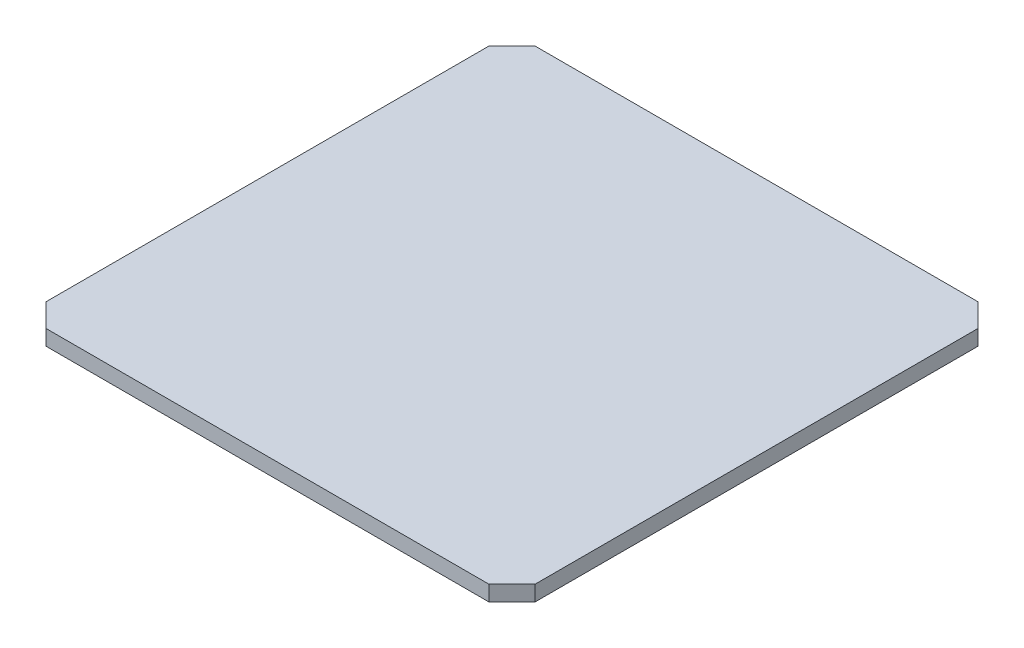
ISO-10303-21;
HEADER;
FILE_DESCRIPTION(('STEP AP214'),'2;1');
FILE_NAME('part.step','',(''),(''),'','','');
FILE_SCHEMA(('AUTOMOTIVE_DESIGN { 1 0 10303 214 1 1 1 1 }'));
ENDSEC;
DATA;
#1=APPLICATION_CONTEXT('core data for automotive mechanical design processes');
#2=APPLICATION_PROTOCOL_DEFINITION('international standard','automotive_design',2000,#1);
#3=PRODUCT_CONTEXT('',#1,'mechanical');
#4=PRODUCT('Part','Part','',(#3));
#5=PRODUCT_RELATED_PRODUCT_CATEGORY('part','',(#4));
#6=PRODUCT_DEFINITION_FORMATION('','',#4);
#7=PRODUCT_DEFINITION_CONTEXT('part definition',#1,'design');
#8=PRODUCT_DEFINITION('design','',#6,#7);
#9=PRODUCT_DEFINITION_SHAPE('','',#8);
#10=(LENGTH_UNIT() NAMED_UNIT(*) SI_UNIT(.MILLI.,.METRE.));
#11=(NAMED_UNIT(*) PLANE_ANGLE_UNIT() SI_UNIT($,.RADIAN.));
#12=(NAMED_UNIT(*) SI_UNIT($,.STERADIAN.) SOLID_ANGLE_UNIT());
#13=UNCERTAINTY_MEASURE_WITH_UNIT(LENGTH_MEASURE(1.E-05),#10,'distance_accuracy_value','');
#14=(GEOMETRIC_REPRESENTATION_CONTEXT(3) GLOBAL_UNCERTAINTY_ASSIGNED_CONTEXT((#13)) GLOBAL_UNIT_ASSIGNED_CONTEXT((#10,
#11,#12)) REPRESENTATION_CONTEXT('',''));
#15=CARTESIAN_POINT('',(0.,0.,0.));
#16=DIRECTION('',(0.,0.,1.));
#17=DIRECTION('',(1.,0.,0.));
#18=AXIS2_PLACEMENT_3D('',#15,#16,#17);
#19=CARTESIAN_POINT('',(0.,0.8,0.));
#20=DIRECTION('',(1.,0.,0.));
#21=DIRECTION('',(0.,0.,-1.));
#22=AXIS2_PLACEMENT_3D('',#19,#20,#21);
#23=PLANE('',#22);
#24=DIRECTION('',(0.,0.,1.));
#25=VECTOR('',#24,1.);
#26=CARTESIAN_POINT('',(0.,0.8,0.));
#27=LINE('',#26,#25);
#28=CARTESIAN_POINT('',(0.,0.8,-24.2));
#29=VERTEX_POINT('',#28);
#30=CARTESIAN_POINT('',(0.,0.8,-1.2));
#31=VERTEX_POINT('',#30);
#32=EDGE_CURVE('E117',#29,#31,#27,.T.);
#33=ORIENTED_EDGE('',*,*,#32,.F.);
#34=DIRECTION('',(0.,-1.,0.));
#35=VECTOR('',#34,1.);
#36=CARTESIAN_POINT('',(0.,0.8,-24.2));
#37=LINE('',#36,#35);
#38=CARTESIAN_POINT('',(0.,0.,-24.2));
#39=VERTEX_POINT('',#38);
#40=EDGE_CURVE('E102',#29,#39,#37,.T.);
#41=ORIENTED_EDGE('',*,*,#40,.T.);
#42=DIRECTION('',(0.,0.,1.));
#43=VECTOR('',#42,1.);
#44=CARTESIAN_POINT('',(0.,0.,0.));
#45=LINE('',#44,#43);
#46=CARTESIAN_POINT('',(0.,0.,-1.2));
#47=VERTEX_POINT('',#46);
#48=EDGE_CURVE('E114',#39,#47,#45,.T.);
#49=ORIENTED_EDGE('',*,*,#48,.T.);
#50=DIRECTION('',(0.,1.,0.));
#51=VECTOR('',#50,1.);
#52=CARTESIAN_POINT('',(0.,0.8,-1.2));
#53=LINE('',#52,#51);
#54=EDGE_CURVE('E119',#47,#31,#53,.T.);
#55=ORIENTED_EDGE('',*,*,#54,.T.);
#56=EDGE_LOOP('',(#33,#41,#49,#55));
#57=FACE_BOUND('',#56,.T.);
#58=ADVANCED_FACE('F32',(#57),#23,.F.);
#59=CARTESIAN_POINT('',(0.,0.8,0.));
#60=DIRECTION('',(0.,0.,-1.));
#61=DIRECTION('',(-1.,0.,0.));
#62=AXIS2_PLACEMENT_3D('',#59,#60,#61);
#63=PLANE('',#62);
#64=DIRECTION('',(1.,0.,0.));
#65=VECTOR('',#64,1.);
#66=CARTESIAN_POINT('',(0.,0.8,0.));
#67=LINE('',#66,#65);
#68=CARTESIAN_POINT('',(1.2,0.8,0.));
#69=VERTEX_POINT('',#68);
#70=CARTESIAN_POINT('',(24.2,0.8,0.));
#71=VERTEX_POINT('',#70);
#72=EDGE_CURVE('E159',#69,#71,#67,.T.);
#73=ORIENTED_EDGE('',*,*,#72,.F.);
#74=DIRECTION('',(0.,-1.,0.));
#75=VECTOR('',#74,1.);
#76=CARTESIAN_POINT('',(1.2,0.8,0.));
#77=LINE('',#76,#75);
#78=CARTESIAN_POINT('',(1.2,0.,0.));
#79=VERTEX_POINT('',#78);
#80=EDGE_CURVE('E152',#69,#79,#77,.T.);
#81=ORIENTED_EDGE('',*,*,#80,.T.);
#82=DIRECTION('',(1.,0.,0.));
#83=VECTOR('',#82,1.);
#84=CARTESIAN_POINT('',(0.,0.,0.));
#85=LINE('',#84,#83);
#86=CARTESIAN_POINT('',(24.2,0.,0.));
#87=VERTEX_POINT('',#86);
#88=EDGE_CURVE('E123',#79,#87,#85,.T.);
#89=ORIENTED_EDGE('',*,*,#88,.T.);
#90=DIRECTION('',(0.,1.,0.));
#91=VECTOR('',#90,1.);
#92=CARTESIAN_POINT('',(24.2,0.8,0.));
#93=LINE('',#92,#91);
#94=EDGE_CURVE('E150',#87,#71,#93,.T.);
#95=ORIENTED_EDGE('',*,*,#94,.T.);
#96=EDGE_LOOP('',(#73,#81,#89,#95));
#97=FACE_BOUND('',#96,.T.);
#98=ADVANCED_FACE('F157',(#97),#63,.F.);
#99=CARTESIAN_POINT('',(25.4,0.8,0.));
#100=DIRECTION('',(-1.,0.,0.));
#101=DIRECTION('',(0.,0.,1.));
#102=AXIS2_PLACEMENT_3D('',#99,#100,#101);
#103=PLANE('',#102);
#104=DIRECTION('',(0.,0.,-1.));
#105=VECTOR('',#104,1.);
#106=CARTESIAN_POINT('',(25.4,0.8,0.));
#107=LINE('',#106,#105);
#108=CARTESIAN_POINT('',(25.4,0.8,-1.2));
#109=VERTEX_POINT('',#108);
#110=CARTESIAN_POINT('',(25.4,0.8,-24.2));
#111=VERTEX_POINT('',#110);
#112=EDGE_CURVE('E167',#109,#111,#107,.T.);
#113=ORIENTED_EDGE('',*,*,#112,.F.);
#114=DIRECTION('',(0.,-1.,0.));
#115=VECTOR('',#114,1.);
#116=CARTESIAN_POINT('',(25.4,0.8,-1.2));
#117=LINE('',#116,#115);
#118=CARTESIAN_POINT('',(25.4,0.,-1.2));
#119=VERTEX_POINT('',#118);
#120=EDGE_CURVE('E11',#109,#119,#117,.T.);
#121=ORIENTED_EDGE('',*,*,#120,.T.);
#122=DIRECTION('',(0.,0.,-1.));
#123=VECTOR('',#122,1.);
#124=CARTESIAN_POINT('',(25.4,0.,0.));
#125=LINE('',#124,#123);
#126=CARTESIAN_POINT('',(25.4,0.,-24.2));
#127=VERTEX_POINT('',#126);
#128=EDGE_CURVE('E126',#119,#127,#125,.T.);
#129=ORIENTED_EDGE('',*,*,#128,.T.);
#130=DIRECTION('',(0.,1.,0.));
#131=VECTOR('',#130,1.);
#132=CARTESIAN_POINT('',(25.4,0.8,-24.2));
#133=LINE('',#132,#131);
#134=EDGE_CURVE('E40',#127,#111,#133,.T.);
#135=ORIENTED_EDGE('',*,*,#134,.T.);
#136=EDGE_LOOP('',(#113,#121,#129,#135));
#137=FACE_BOUND('',#136,.T.);
#138=ADVANCED_FACE('F166',(#137),#103,.F.);
#139=CARTESIAN_POINT('',(0.,0.8,-25.4));
#140=DIRECTION('',(0.,0.,1.));
#141=DIRECTION('',(1.,0.,0.));
#142=AXIS2_PLACEMENT_3D('',#139,#140,#141);
#143=PLANE('',#142);
#144=DIRECTION('',(-1.,0.,0.));
#145=VECTOR('',#144,1.);
#146=CARTESIAN_POINT('',(0.,0.,-25.4));
#147=LINE('',#146,#145);
#148=CARTESIAN_POINT('',(24.2,0.,-25.4));
#149=VERTEX_POINT('',#148);
#150=CARTESIAN_POINT('',(1.2,0.,-25.4));
#151=VERTEX_POINT('',#150);
#152=EDGE_CURVE('E133',#149,#151,#147,.T.);
#153=ORIENTED_EDGE('',*,*,#152,.T.);
#154=DIRECTION('',(0.,1.,0.));
#155=VECTOR('',#154,1.);
#156=CARTESIAN_POINT('',(1.2,0.8,-25.4));
#157=LINE('',#156,#155);
#158=CARTESIAN_POINT('',(1.2,0.8,-25.4));
#159=VERTEX_POINT('',#158);
#160=EDGE_CURVE('E103',#151,#159,#157,.T.);
#161=ORIENTED_EDGE('',*,*,#160,.T.);
#162=DIRECTION('',(-1.,0.,0.));
#163=VECTOR('',#162,1.);
#164=CARTESIAN_POINT('',(0.,0.8,-25.4));
#165=LINE('',#164,#163);
#166=CARTESIAN_POINT('',(24.2,0.8,-25.4));
#167=VERTEX_POINT('',#166);
#168=EDGE_CURVE('E129',#167,#159,#165,.T.);
#169=ORIENTED_EDGE('',*,*,#168,.F.);
#170=DIRECTION('',(0.,-1.,0.));
#171=VECTOR('',#170,1.);
#172=CARTESIAN_POINT('',(24.2,0.8,-25.4));
#173=LINE('',#172,#171);
#174=EDGE_CURVE('E108',#167,#149,#173,.T.);
#175=ORIENTED_EDGE('',*,*,#174,.T.);
#176=EDGE_LOOP('',(#153,#161,#169,#175));
#177=FACE_BOUND('',#176,.T.);
#178=ADVANCED_FACE('F190',(#177),#143,.F.);
#179=CARTESIAN_POINT('',(0.,0.8,0.));
#180=DIRECTION('',(0.,-1.,0.));
#181=DIRECTION('',(0.,0.,-1.));
#182=AXIS2_PLACEMENT_3D('',#179,#180,#181);
#183=PLANE('',#182);
#184=ORIENTED_EDGE('',*,*,#168,.T.);
#185=DIRECTION('',(0.707106781186549,0.,-0.707106781186547));
#186=VECTOR('',#185,1.);
#187=CARTESIAN_POINT('',(0.,0.8,-24.2));
#188=LINE('',#187,#186);
#189=EDGE_CURVE('E148',#159,#29,#188,.F.);
#190=ORIENTED_EDGE('',*,*,#189,.T.);
#191=ORIENTED_EDGE('',*,*,#32,.T.);
#192=DIRECTION('',(-0.707106781186547,0.,-0.707106781186549));
#193=VECTOR('',#192,1.);
#194=CARTESIAN_POINT('',(1.2,0.8,0.));
#195=LINE('',#194,#193);
#196=EDGE_CURVE('E146',#31,#69,#195,.F.);
#197=ORIENTED_EDGE('',*,*,#196,.T.);
#198=ORIENTED_EDGE('',*,*,#72,.T.);
#199=DIRECTION('',(-0.707106781186549,0.,0.707106781186547));
#200=VECTOR('',#199,1.);
#201=CARTESIAN_POINT('',(25.4,0.8,-1.2));
#202=LINE('',#201,#200);
#203=EDGE_CURVE('E53',#71,#109,#202,.F.);
#204=ORIENTED_EDGE('',*,*,#203,.T.);
#205=ORIENTED_EDGE('',*,*,#112,.T.);
#206=DIRECTION('',(0.707106781186547,0.,0.707106781186549));
#207=VECTOR('',#206,1.);
#208=CARTESIAN_POINT('',(24.2,0.8,-25.4));
#209=LINE('',#208,#207);
#210=EDGE_CURVE('E143',#111,#167,#209,.F.);
#211=ORIENTED_EDGE('',*,*,#210,.T.);
#212=EDGE_LOOP('',(#184,#190,#191,#197,#198,#204,#205,#211));
#213=FACE_BOUND('',#212,.T.);
#214=ADVANCED_FACE('F172',(#213),#183,.F.);
#215=CARTESIAN_POINT('',(0.,0.,0.));
#216=DIRECTION('',(0.,-1.,0.));
#217=DIRECTION('',(0.,0.,-1.));
#218=AXIS2_PLACEMENT_3D('',#215,#216,#217);
#219=PLANE('',#218);
#220=ORIENTED_EDGE('',*,*,#48,.F.);
#221=DIRECTION('',(-0.707106781186549,0.,0.707106781186547));
#222=VECTOR('',#221,1.);
#223=CARTESIAN_POINT('',(-12.1,0.,-12.1));
#224=LINE('',#223,#222);
#225=EDGE_CURVE('E98',#39,#151,#224,.F.);
#226=ORIENTED_EDGE('',*,*,#225,.T.);
#227=ORIENTED_EDGE('',*,*,#152,.F.);
#228=DIRECTION('',(-0.707106781186547,0.,-0.707106781186549));
#229=VECTOR('',#228,1.);
#230=CARTESIAN_POINT('',(24.8,0.,-24.8));
#231=LINE('',#230,#229);
#232=EDGE_CURVE('E118',#149,#127,#231,.F.);
#233=ORIENTED_EDGE('',*,*,#232,.T.);
#234=ORIENTED_EDGE('',*,*,#128,.F.);
#235=DIRECTION('',(0.707106781186549,0.,-0.707106781186547));
#236=VECTOR('',#235,1.);
#237=CARTESIAN_POINT('',(12.1,0.,12.1));
#238=LINE('',#237,#236);
#239=EDGE_CURVE('E137',#119,#87,#238,.F.);
#240=ORIENTED_EDGE('',*,*,#239,.T.);
#241=ORIENTED_EDGE('',*,*,#88,.F.);
#242=DIRECTION('',(0.707106781186547,0.,0.707106781186549));
#243=VECTOR('',#242,1.);
#244=CARTESIAN_POINT('',(0.600000000000002,0.,-0.6));
#245=LINE('',#244,#243);
#246=EDGE_CURVE('E109',#79,#47,#245,.F.);
#247=ORIENTED_EDGE('',*,*,#246,.T.);
#248=EDGE_LOOP('',(#220,#226,#227,#233,#234,#240,#241,#247));
#249=FACE_BOUND('',#248,.T.);
#250=ADVANCED_FACE('F121',(#249),#219,.T.);
#251=CARTESIAN_POINT('',(0.,0.8,-24.2));
#252=DIRECTION('',(0.707106781186547,0.,0.707106781186549));
#253=DIRECTION('',(0.,-1.,0.));
#254=AXIS2_PLACEMENT_3D('',#251,#252,#253);
#255=PLANE('',#254);
#256=ORIENTED_EDGE('',*,*,#189,.F.);
#257=ORIENTED_EDGE('',*,*,#160,.F.);
#258=ORIENTED_EDGE('',*,*,#225,.F.);
#259=ORIENTED_EDGE('',*,*,#40,.F.);
#260=EDGE_LOOP('',(#256,#257,#258,#259));
#261=FACE_BOUND('',#260,.T.);
#262=ADVANCED_FACE('F101',(#261),#255,.F.);
#263=CARTESIAN_POINT('',(1.2,0.8,0.));
#264=DIRECTION('',(0.707106781186549,0.,-0.707106781186547));
#265=DIRECTION('',(0.,-1.,0.));
#266=AXIS2_PLACEMENT_3D('',#263,#264,#265);
#267=PLANE('',#266);
#268=ORIENTED_EDGE('',*,*,#196,.F.);
#269=ORIENTED_EDGE('',*,*,#54,.F.);
#270=ORIENTED_EDGE('',*,*,#246,.F.);
#271=ORIENTED_EDGE('',*,*,#80,.F.);
#272=EDGE_LOOP('',(#268,#269,#270,#271));
#273=FACE_BOUND('',#272,.T.);
#274=ADVANCED_FACE('F173',(#273),#267,.F.);
#275=CARTESIAN_POINT('',(25.4,0.8,-1.2));
#276=DIRECTION('',(-0.707106781186547,0.,-0.707106781186549));
#277=DIRECTION('',(0.,-1.,0.));
#278=AXIS2_PLACEMENT_3D('',#275,#276,#277);
#279=PLANE('',#278);
#280=ORIENTED_EDGE('',*,*,#203,.F.);
#281=ORIENTED_EDGE('',*,*,#94,.F.);
#282=ORIENTED_EDGE('',*,*,#239,.F.);
#283=ORIENTED_EDGE('',*,*,#120,.F.);
#284=EDGE_LOOP('',(#280,#281,#282,#283));
#285=FACE_BOUND('',#284,.T.);
#286=ADVANCED_FACE('F165',(#285),#279,.F.);
#287=CARTESIAN_POINT('',(24.2,0.8,-25.4));
#288=DIRECTION('',(-0.707106781186549,0.,0.707106781186547));
#289=DIRECTION('',(0.,-1.,0.));
#290=AXIS2_PLACEMENT_3D('',#287,#288,#289);
#291=PLANE('',#290);
#292=ORIENTED_EDGE('',*,*,#210,.F.);
#293=ORIENTED_EDGE('',*,*,#134,.F.);
#294=ORIENTED_EDGE('',*,*,#232,.F.);
#295=ORIENTED_EDGE('',*,*,#174,.F.);
#296=EDGE_LOOP('',(#292,#293,#294,#295));
#297=FACE_BOUND('',#296,.T.);
#298=ADVANCED_FACE('F34',(#297),#291,.F.);
#299=CLOSED_SHELL('',(#58,#98,#138,#178,#214,#250,#262,#274,#286,#298));
#300=MANIFOLD_SOLID_BREP('B2',#299);
#301=ADVANCED_BREP_SHAPE_REPRESENTATION('',(#18,#300),#14);
#302=SHAPE_DEFINITION_REPRESENTATION(#9,#301);
ENDSEC;
END-ISO-10303-21;
